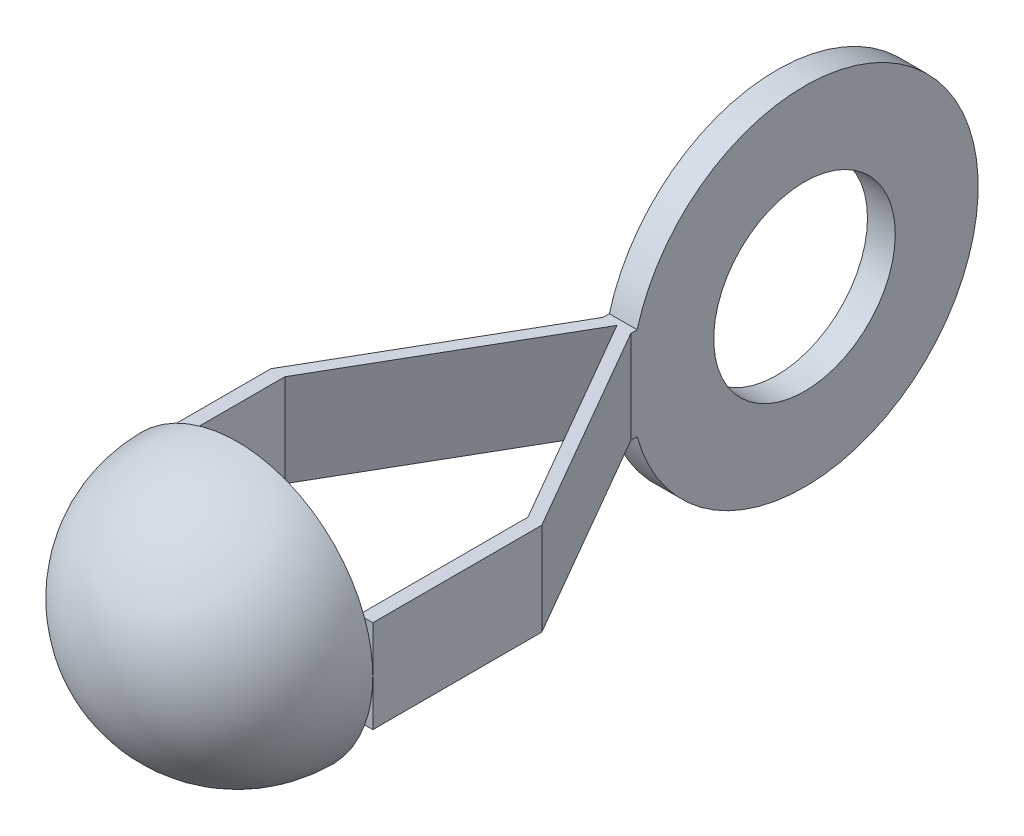
ISO-10303-21;
HEADER;
FILE_DESCRIPTION(('STEP AP214'),'2;1');
FILE_NAME('part.step','',(''),(''),'','','');
FILE_SCHEMA(('AUTOMOTIVE_DESIGN { 1 0 10303 214 1 1 1 1 }'));
ENDSEC;
DATA;
#1=APPLICATION_CONTEXT('core data for automotive mechanical design processes');
#2=APPLICATION_PROTOCOL_DEFINITION('international standard','automotive_design',2000,#1);
#3=PRODUCT_CONTEXT('',#1,'mechanical');
#4=PRODUCT('Part','Part','',(#3));
#5=PRODUCT_RELATED_PRODUCT_CATEGORY('part','',(#4));
#6=PRODUCT_DEFINITION_FORMATION('','',#4);
#7=PRODUCT_DEFINITION_CONTEXT('part definition',#1,'design');
#8=PRODUCT_DEFINITION('design','',#6,#7);
#9=PRODUCT_DEFINITION_SHAPE('','',#8);
#10=(LENGTH_UNIT() NAMED_UNIT(*) SI_UNIT(.MILLI.,.METRE.));
#11=(NAMED_UNIT(*) PLANE_ANGLE_UNIT() SI_UNIT($,.RADIAN.));
#12=(NAMED_UNIT(*) SI_UNIT($,.STERADIAN.) SOLID_ANGLE_UNIT());
#13=UNCERTAINTY_MEASURE_WITH_UNIT(LENGTH_MEASURE(1.E-05),#10,'distance_accuracy_value','');
#14=(GEOMETRIC_REPRESENTATION_CONTEXT(3) GLOBAL_UNCERTAINTY_ASSIGNED_CONTEXT((#13)) GLOBAL_UNIT_ASSIGNED_CONTEXT((#10,
#11,#12)) REPRESENTATION_CONTEXT('',''));
#15=CARTESIAN_POINT('',(0.,0.,0.));
#16=DIRECTION('',(0.,0.,1.));
#17=DIRECTION('',(1.,0.,0.));
#18=AXIS2_PLACEMENT_3D('',#15,#16,#17);
#19=CARTESIAN_POINT('',(-3.33375000000001,4.7625,10.4097243797327));
#20=DIRECTION('',(0.,0.,1.));
#21=DIRECTION('',(1.,0.,0.));
#22=AXIS2_PLACEMENT_3D('',#19,#20,#21);
#23=PLANE('',#22);
#24=DIRECTION('',(-1.,0.,0.));
#25=VECTOR('',#24,1.);
#26=CARTESIAN_POINT('',(3.71475000000001,-1.27,10.4097243797327));
#27=LINE('',#26,#25);
#28=CARTESIAN_POINT('',(-3.49091213904046,-1.27,10.4097243797327));
#29=VERTEX_POINT('',#28);
#30=CARTESIAN_POINT('',(-3.71475000000001,-1.27,10.4097243797327));
#31=VERTEX_POINT('',#30);
#32=EDGE_CURVE('E582',#29,#31,#27,.T.);
#33=ORIENTED_EDGE('',*,*,#32,.F.);
#34=CARTESIAN_POINT('',(0.,0.,10.4097243797327));
#35=DIRECTION('',(0.,0.,-1.));
#36=DIRECTION('',(1.,0.,0.));
#37=AXIS2_PLACEMENT_3D('',#34,#35,#36);
#38=CIRCLE('',#37,3.71475000000001);
#39=CARTESIAN_POINT('',(-3.71475000000001,0.,10.4097243797327));
#40=VERTEX_POINT('',#39);
#41=EDGE_CURVE('E348',#29,#40,#38,.T.);
#42=ORIENTED_EDGE('',*,*,#41,.T.);
#43=DIRECTION('',(0.,-1.,0.));
#44=VECTOR('',#43,1.);
#45=CARTESIAN_POINT('',(-3.71475000000001,4.7625,10.4097243797327));
#46=LINE('',#45,#44);
#47=EDGE_CURVE('E546',#40,#31,#46,.T.);
#48=ORIENTED_EDGE('',*,*,#47,.T.);
#49=EDGE_LOOP('',(#33,#42,#48));
#50=FACE_BOUND('',#49,.T.);
#51=ADVANCED_FACE('F325',(#50),#23,.T.);
#52=CARTESIAN_POINT('',(3.33375000000001,4.7625,10.4097243797327));
#53=DIRECTION('',(0.,0.,-1.));
#54=DIRECTION('',(-1.,0.,0.));
#55=AXIS2_PLACEMENT_3D('',#52,#53,#54);
#56=PLANE('',#55);
#57=CARTESIAN_POINT('',(3.71475000000001,0.,10.4097243797327));
#58=VERTEX_POINT('',#57);
#59=CARTESIAN_POINT('',(3.49091213904046,-1.27,10.4097243797328));
#60=VERTEX_POINT('',#59);
#61=EDGE_CURVE('E446',#58,#60,#38,.T.);
#62=ORIENTED_EDGE('',*,*,#61,.T.);
#63=DIRECTION('',(1.,0.,0.));
#64=VECTOR('',#63,1.);
#65=CARTESIAN_POINT('',(0.,-1.27,10.4097243797327));
#66=LINE('',#65,#64);
#67=CARTESIAN_POINT('',(3.71475000000001,-1.27,10.4097243797327));
#68=VERTEX_POINT('',#67);
#69=EDGE_CURVE('E471',#60,#68,#66,.T.);
#70=ORIENTED_EDGE('',*,*,#69,.T.);
#71=DIRECTION('',(0.,-1.,0.));
#72=VECTOR('',#71,1.);
#73=CARTESIAN_POINT('',(3.71475000000001,4.7625,10.4097243797327));
#74=LINE('',#73,#72);
#75=EDGE_CURVE('E469',#58,#68,#74,.T.);
#76=ORIENTED_EDGE('',*,*,#75,.F.);
#77=EDGE_LOOP('',(#62,#70,#76));
#78=FACE_BOUND('',#77,.T.);
#79=ADVANCED_FACE('F470',(#78),#56,.F.);
#80=CARTESIAN_POINT('',(0.,4.7625,0.));
#81=DIRECTION('',(0.866025403784438,0.,0.500000000000001));
#82=DIRECTION('',(0.500000000000001,0.,-0.866025403784438));
#83=AXIS2_PLACEMENT_3D('',#80,#81,#82);
#84=PLANE('',#83);
#85=DIRECTION('',(0.,-1.,0.));
#86=VECTOR('',#85,1.);
#87=CARTESIAN_POINT('',(0.,4.7625,0.));
#88=LINE('',#87,#86);
#89=CARTESIAN_POINT('',(0.,1.27,0.));
#90=VERTEX_POINT('',#89);
#91=CARTESIAN_POINT('',(0.,-1.27,0.));
#92=VERTEX_POINT('',#91);
#93=EDGE_CURVE('E489',#90,#92,#88,.T.);
#94=ORIENTED_EDGE('',*,*,#93,.F.);
#95=DIRECTION('',(-0.500000000000001,0.,0.866025403784438));
#96=VECTOR('',#95,1.);
#97=CARTESIAN_POINT('',(0.,1.27,0.));
#98=LINE('',#97,#96);
#99=CARTESIAN_POINT('',(-3.33375000000001,1.27,5.77422437973274));
#100=VERTEX_POINT('',#99);
#101=EDGE_CURVE('E564',#90,#100,#98,.T.);
#102=ORIENTED_EDGE('',*,*,#101,.T.);
#103=DIRECTION('',(0.,-1.,0.));
#104=VECTOR('',#103,1.);
#105=CARTESIAN_POINT('',(-3.33375000000001,4.7625,5.77422437973274));
#106=LINE('',#105,#104);
#107=CARTESIAN_POINT('',(-3.33375000000001,-1.27,5.77422437973274));
#108=VERTEX_POINT('',#107);
#109=EDGE_CURVE('E548',#100,#108,#106,.T.);
#110=ORIENTED_EDGE('',*,*,#109,.T.);
#111=DIRECTION('',(-0.500000000000001,0.,0.866025403784438));
#112=VECTOR('',#111,1.);
#113=CARTESIAN_POINT('',(0.,-1.27,0.));
#114=LINE('',#113,#112);
#115=EDGE_CURVE('E575',#92,#108,#114,.T.);
#116=ORIENTED_EDGE('',*,*,#115,.F.);
#117=EDGE_LOOP('',(#94,#102,#110,#116));
#118=FACE_BOUND('',#117,.T.);
#119=ADVANCED_FACE('F615',(#118),#84,.T.);
#120=CARTESIAN_POINT('',(-3.33375000000001,4.7625,5.77422437973274));
#121=DIRECTION('',(1.,0.,0.));
#122=DIRECTION('',(0.,0.,-1.));
#123=AXIS2_PLACEMENT_3D('',#120,#121,#122);
#124=PLANE('',#123);
#125=ORIENTED_EDGE('',*,*,#109,.F.);
#126=DIRECTION('',(0.,0.,1.));
#127=VECTOR('',#126,1.);
#128=CARTESIAN_POINT('',(-3.33375000000001,1.27,5.77422437973274));
#129=LINE('',#128,#127);
#130=CARTESIAN_POINT('',(-3.33375000000001,1.27,10.4097243797327));
#131=VERTEX_POINT('',#130);
#132=EDGE_CURVE('E562',#100,#131,#129,.T.);
#133=ORIENTED_EDGE('',*,*,#132,.T.);
#134=DIRECTION('',(0.,-1.,0.));
#135=VECTOR('',#134,1.);
#136=CARTESIAN_POINT('',(-3.33375000000001,4.7625,10.4097243797327));
#137=LINE('',#136,#135);
#138=CARTESIAN_POINT('',(-3.33375000000001,0.,10.4097243797327));
#139=VERTEX_POINT('',#138);
#140=EDGE_CURVE('E340',#131,#139,#137,.T.);
#141=ORIENTED_EDGE('',*,*,#140,.T.);
#142=DIRECTION('',(0.,1.,0.));
#143=VECTOR('',#142,1.);
#144=CARTESIAN_POINT('',(-3.33375000000001,4.76250000000003,10.4097243797327));
#145=LINE('',#144,#143);
#146=CARTESIAN_POINT('',(-3.33375000000001,-1.27,10.4097243797327));
#147=VERTEX_POINT('',#146);
#148=EDGE_CURVE('E585',#147,#139,#145,.T.);
#149=ORIENTED_EDGE('',*,*,#148,.F.);
#150=DIRECTION('',(0.,0.,1.));
#151=VECTOR('',#150,1.);
#152=CARTESIAN_POINT('',(-3.33375000000001,-1.27,5.77422437973274));
#153=LINE('',#152,#151);
#154=EDGE_CURVE('E572',#108,#147,#153,.T.);
#155=ORIENTED_EDGE('',*,*,#154,.F.);
#156=EDGE_LOOP('',(#125,#133,#141,#149,#155));
#157=FACE_BOUND('',#156,.T.);
#158=ADVANCED_FACE('F618',(#157),#124,.T.);
#159=CARTESIAN_POINT('',(-3.71475000000001,1.27,10.4097243797327));
#160=VERTEX_POINT('',#159);
#161=EDGE_CURVE('E543',#160,#40,#46,.T.);
#162=ORIENTED_EDGE('',*,*,#161,.T.);
#163=CARTESIAN_POINT('',(-3.49091213904046,1.27,10.4097243797327));
#164=VERTEX_POINT('',#163);
#165=EDGE_CURVE('E623',#40,#164,#38,.T.);
#166=ORIENTED_EDGE('',*,*,#165,.T.);
#167=DIRECTION('',(-1.,0.,0.));
#168=VECTOR('',#167,1.);
#169=CARTESIAN_POINT('',(3.71475000000001,1.27,10.4097243797327));
#170=LINE('',#169,#168);
#171=EDGE_CURVE('E588',#164,#160,#170,.T.);
#172=ORIENTED_EDGE('',*,*,#171,.T.);
#173=EDGE_LOOP('',(#162,#166,#172));
#174=FACE_BOUND('',#173,.T.);
#175=ADVANCED_FACE('F648',(#174),#23,.T.);
#176=CARTESIAN_POINT('',(-3.71475000000001,4.7625,10.4097243797327));
#177=DIRECTION('',(-1.,0.,0.));
#178=DIRECTION('',(0.,0.,1.));
#179=AXIS2_PLACEMENT_3D('',#176,#177,#178);
#180=PLANE('',#179);
#181=ORIENTED_EDGE('',*,*,#161,.F.);
#182=DIRECTION('',(0.,0.,-1.));
#183=VECTOR('',#182,1.);
#184=CARTESIAN_POINT('',(-3.71475000000001,1.27,0.));
#185=LINE('',#184,#183);
#186=CARTESIAN_POINT('',(-3.71475000000001,1.27,5.77422437973274));
#187=VERTEX_POINT('',#186);
#188=EDGE_CURVE('E581',#160,#187,#185,.T.);
#189=ORIENTED_EDGE('',*,*,#188,.T.);
#190=DIRECTION('',(0.,-1.,0.));
#191=VECTOR('',#190,1.);
#192=CARTESIAN_POINT('',(-3.71475000000001,4.7625,5.77422437973274));
#193=LINE('',#192,#191);
#194=CARTESIAN_POINT('',(-3.71475000000001,-1.27,5.77422437973274));
#195=VERTEX_POINT('',#194);
#196=EDGE_CURVE('E540',#187,#195,#193,.T.);
#197=ORIENTED_EDGE('',*,*,#196,.T.);
#198=DIRECTION('',(0.,0.,-1.));
#199=VECTOR('',#198,1.);
#200=CARTESIAN_POINT('',(-3.71475000000001,-1.27,0.));
#201=LINE('',#200,#199);
#202=EDGE_CURVE('E583',#31,#195,#201,.T.);
#203=ORIENTED_EDGE('',*,*,#202,.F.);
#204=ORIENTED_EDGE('',*,*,#47,.F.);
#205=EDGE_LOOP('',(#181,#189,#197,#203,#204));
#206=FACE_BOUND('',#205,.T.);
#207=ADVANCED_FACE('F630',(#206),#180,.T.);
#208=CARTESIAN_POINT('',(-3.71475000000001,4.7625,5.77422437973274));
#209=DIRECTION('',(-0.866025403784438,0.,-0.500000000000001));
#210=DIRECTION('',(-0.500000000000001,0.,0.866025403784438));
#211=AXIS2_PLACEMENT_3D('',#208,#209,#210);
#212=PLANE('',#211);
#213=ORIENTED_EDGE('',*,*,#196,.F.);
#214=DIRECTION('',(0.500000000000001,0.,-0.866025403784438));
#215=VECTOR('',#214,1.);
#216=CARTESIAN_POINT('',(-3.71475000000001,1.27,5.77422437973274));
#217=LINE('',#216,#215);
#218=CARTESIAN_POINT('',(-0.381000000000001,1.27,0.));
#219=VERTEX_POINT('',#218);
#220=EDGE_CURVE('E559',#187,#219,#217,.T.);
#221=ORIENTED_EDGE('',*,*,#220,.T.);
#222=DIRECTION('',(0.,-1.,0.));
#223=VECTOR('',#222,1.);
#224=CARTESIAN_POINT('',(-0.381,4.7625,0.));
#225=LINE('',#224,#223);
#226=CARTESIAN_POINT('',(-0.381000000000001,-1.27,0.));
#227=VERTEX_POINT('',#226);
#228=EDGE_CURVE('E509',#219,#227,#225,.T.);
#229=ORIENTED_EDGE('',*,*,#228,.T.);
#230=DIRECTION('',(0.500000000000001,0.,-0.866025403784438));
#231=VECTOR('',#230,1.);
#232=CARTESIAN_POINT('',(-3.71475000000001,-1.27,5.77422437973274));
#233=LINE('',#232,#231);
#234=EDGE_CURVE('E570',#195,#227,#233,.T.);
#235=ORIENTED_EDGE('',*,*,#234,.F.);
#236=EDGE_LOOP('',(#213,#221,#229,#235));
#237=FACE_BOUND('',#236,.T.);
#238=ADVANCED_FACE('F634',(#237),#212,.T.);
#239=CARTESIAN_POINT('',(-0.381,4.7625,0.));
#240=DIRECTION('',(-1.,0.,0.));
#241=DIRECTION('',(0.,0.,1.));
#242=AXIS2_PLACEMENT_3D('',#239,#240,#241);
#243=PLANE('',#242);
#244=DIRECTION('',(0.,0.,-1.));
#245=VECTOR('',#244,1.);
#246=CARTESIAN_POINT('',(-0.381,1.27,0.));
#247=LINE('',#246,#245);
#248=CARTESIAN_POINT('',(-0.381,1.27,-0.172455746400693));
#249=VERTEX_POINT('',#248);
#250=EDGE_CURVE('E556',#219,#249,#247,.T.);
#251=ORIENTED_EDGE('',*,*,#250,.T.);
#252=CARTESIAN_POINT('',(-0.381,0.,-4.7625));
#253=DIRECTION('',(-1.,0.,0.));
#254=DIRECTION('',(0.,0.,1.));
#255=AXIS2_PLACEMENT_3D('',#252,#253,#254);
#256=CIRCLE('',#255,4.7625);
#257=CARTESIAN_POINT('',(-0.381,-1.27,-0.172455746400693));
#258=VERTEX_POINT('',#257);
#259=EDGE_CURVE('E551',#258,#249,#256,.F.);
#260=ORIENTED_EDGE('',*,*,#259,.F.);
#261=DIRECTION('',(0.,0.,-1.));
#262=VECTOR('',#261,1.);
#263=CARTESIAN_POINT('',(-0.381,-1.27,0.));
#264=LINE('',#263,#262);
#265=EDGE_CURVE('E567',#227,#258,#264,.T.);
#266=ORIENTED_EDGE('',*,*,#265,.F.);
#267=ORIENTED_EDGE('',*,*,#228,.F.);
#268=EDGE_LOOP('',(#251,#260,#266,#267));
#269=FACE_BOUND('',#268,.T.);
#270=CARTESIAN_POINT('',(-0.381,0.,-4.7625));
#271=DIRECTION('',(-1.,0.,0.));
#272=DIRECTION('',(0.,0.,1.));
#273=AXIS2_PLACEMENT_3D('',#270,#271,#272);
#274=CIRCLE('',#273,2.4892);
#275=CARTESIAN_POINT('',(-0.381,0.,-7.2517));
#276=VERTEX_POINT('',#275);
#277=EDGE_CURVE('E553',#276,#276,#274,.F.);
#278=ORIENTED_EDGE('',*,*,#277,.T.);
#279=EDGE_LOOP('',(#278));
#280=FACE_BOUND('',#279,.T.);
#281=ADVANCED_FACE('F638',(#269,#280),#243,.T.);
#282=CARTESIAN_POINT('',(0.381,4.7625,0.));
#283=DIRECTION('',(-1.,0.,0.));
#284=DIRECTION('',(0.,0.,1.));
#285=AXIS2_PLACEMENT_3D('',#282,#283,#284);
#286=PLANE('',#285);
#287=CARTESIAN_POINT('',(0.381,0.,-4.7625));
#288=DIRECTION('',(-1.,0.,0.));
#289=DIRECTION('',(0.,0.,1.));
#290=AXIS2_PLACEMENT_3D('',#287,#288,#289);
#291=CIRCLE('',#290,2.4892);
#292=CARTESIAN_POINT('',(0.381,0.,-7.2517));
#293=VERTEX_POINT('',#292);
#294=EDGE_CURVE('E492',#293,#293,#291,.T.);
#295=ORIENTED_EDGE('',*,*,#294,.T.);
#296=EDGE_LOOP('',(#295));
#297=FACE_BOUND('',#296,.T.);
#298=CARTESIAN_POINT('',(0.381,0.,-4.7625));
#299=DIRECTION('',(-1.,0.,0.));
#300=DIRECTION('',(0.,0.,1.));
#301=AXIS2_PLACEMENT_3D('',#298,#299,#300);
#302=CIRCLE('',#301,4.7625);
#303=CARTESIAN_POINT('',(0.381,1.27,-0.172455746400693));
#304=VERTEX_POINT('',#303);
#305=CARTESIAN_POINT('',(0.381,-1.27,-0.172455746400693));
#306=VERTEX_POINT('',#305);
#307=EDGE_CURVE('E494',#304,#306,#302,.T.);
#308=ORIENTED_EDGE('',*,*,#307,.F.);
#309=DIRECTION('',(0.,0.,1.));
#310=VECTOR('',#309,1.);
#311=CARTESIAN_POINT('',(0.381,1.27,0.));
#312=LINE('',#311,#310);
#313=CARTESIAN_POINT('',(0.381000000000001,1.27,0.));
#314=VERTEX_POINT('',#313);
#315=EDGE_CURVE('E522',#304,#314,#312,.T.);
#316=ORIENTED_EDGE('',*,*,#315,.T.);
#317=DIRECTION('',(0.,-1.,0.));
#318=VECTOR('',#317,1.);
#319=CARTESIAN_POINT('',(0.381,4.7625,0.));
#320=LINE('',#319,#318);
#321=CARTESIAN_POINT('',(0.381000000000001,-1.27,0.));
#322=VERTEX_POINT('',#321);
#323=EDGE_CURVE('E512',#314,#322,#320,.T.);
#324=ORIENTED_EDGE('',*,*,#323,.T.);
#325=DIRECTION('',(0.,0.,1.));
#326=VECTOR('',#325,1.);
#327=CARTESIAN_POINT('',(0.381,-1.27,0.));
#328=LINE('',#327,#326);
#329=EDGE_CURVE('E503',#306,#322,#328,.T.);
#330=ORIENTED_EDGE('',*,*,#329,.F.);
#331=EDGE_LOOP('',(#308,#316,#324,#330));
#332=FACE_BOUND('',#331,.T.);
#333=ADVANCED_FACE('F644',(#297,#332),#286,.F.);
#334=CARTESIAN_POINT('',(0.,4.7625,0.));
#335=DIRECTION('',(0.866025403784438,0.,-0.500000000000001));
#336=DIRECTION('',(-0.500000000000001,0.,-0.866025403784438));
#337=AXIS2_PLACEMENT_3D('',#334,#335,#336);
#338=PLANE('',#337);
#339=DIRECTION('',(0.,-1.,0.));
#340=VECTOR('',#339,1.);
#341=CARTESIAN_POINT('',(3.33375000000001,4.7625,5.77422437973274));
#342=LINE('',#341,#340);
#343=CARTESIAN_POINT('',(3.33375000000001,1.27,5.77422437973274));
#344=VERTEX_POINT('',#343);
#345=CARTESIAN_POINT('',(3.33375000000001,-1.27,5.77422437973274));
#346=VERTEX_POINT('',#345);
#347=EDGE_CURVE('E482',#344,#346,#342,.T.);
#348=ORIENTED_EDGE('',*,*,#347,.F.);
#349=DIRECTION('',(-0.500000000000001,0.,-0.866025403784438));
#350=VECTOR('',#349,1.);
#351=CARTESIAN_POINT('',(0.,1.27,0.));
#352=LINE('',#351,#350);
#353=EDGE_CURVE('E495',#344,#90,#352,.T.);
#354=ORIENTED_EDGE('',*,*,#353,.T.);
#355=ORIENTED_EDGE('',*,*,#93,.T.);
#356=DIRECTION('',(-0.500000000000001,0.,-0.866025403784438));
#357=VECTOR('',#356,1.);
#358=CARTESIAN_POINT('',(0.,-1.27,0.));
#359=LINE('',#358,#357);
#360=EDGE_CURVE('E524',#346,#92,#359,.T.);
#361=ORIENTED_EDGE('',*,*,#360,.F.);
#362=EDGE_LOOP('',(#348,#354,#355,#361));
#363=FACE_BOUND('',#362,.T.);
#364=ADVANCED_FACE('F327',(#363),#338,.F.);
#365=CARTESIAN_POINT('',(3.33375000000001,4.7625,5.77422437973274));
#366=DIRECTION('',(1.,0.,0.));
#367=DIRECTION('',(0.,0.,-1.));
#368=AXIS2_PLACEMENT_3D('',#365,#366,#367);
#369=PLANE('',#368);
#370=DIRECTION('',(0.,-1.,0.));
#371=VECTOR('',#370,1.);
#372=CARTESIAN_POINT('',(3.33375000000001,4.7625,10.4097243797327));
#373=LINE('',#372,#371);
#374=CARTESIAN_POINT('',(3.33375000000001,1.27,10.4097243797327));
#375=VERTEX_POINT('',#374);
#376=CARTESIAN_POINT('',(3.33375000000001,0.,10.4097243797327));
#377=VERTEX_POINT('',#376);
#378=EDGE_CURVE('E481',#375,#377,#373,.T.);
#379=ORIENTED_EDGE('',*,*,#378,.F.);
#380=DIRECTION('',(0.,0.,-1.));
#381=VECTOR('',#380,1.);
#382=CARTESIAN_POINT('',(3.33375000000001,1.27,5.77422437973274));
#383=LINE('',#382,#381);
#384=EDGE_CURVE('E519',#375,#344,#383,.T.);
#385=ORIENTED_EDGE('',*,*,#384,.T.);
#386=ORIENTED_EDGE('',*,*,#347,.T.);
#387=DIRECTION('',(0.,0.,-1.));
#388=VECTOR('',#387,1.);
#389=CARTESIAN_POINT('',(3.33375000000001,-1.27,5.77422437973274));
#390=LINE('',#389,#388);
#391=CARTESIAN_POINT('',(3.33375000000001,-1.27,10.4097243797328));
#392=VERTEX_POINT('',#391);
#393=EDGE_CURVE('E526',#392,#346,#390,.T.);
#394=ORIENTED_EDGE('',*,*,#393,.F.);
#395=DIRECTION('',(0.,1.,0.));
#396=VECTOR('',#395,1.);
#397=CARTESIAN_POINT('',(3.33375000000001,4.76250000000003,10.4097243797327));
#398=LINE('',#397,#396);
#399=EDGE_CURVE('E458',#392,#377,#398,.T.);
#400=ORIENTED_EDGE('',*,*,#399,.T.);
#401=EDGE_LOOP('',(#379,#385,#386,#394,#400));
#402=FACE_BOUND('',#401,.T.);
#403=ADVANCED_FACE('F609',(#402),#369,.F.);
#404=CARTESIAN_POINT('',(3.49091213904046,1.27,10.4097243797327));
#405=VERTEX_POINT('',#404);
#406=EDGE_CURVE('E450',#405,#58,#38,.T.);
#407=ORIENTED_EDGE('',*,*,#406,.T.);
#408=CARTESIAN_POINT('',(3.71475000000001,1.27,10.4097243797327));
#409=VERTEX_POINT('',#408);
#410=EDGE_CURVE('E464',#409,#58,#74,.T.);
#411=ORIENTED_EDGE('',*,*,#410,.F.);
#412=DIRECTION('',(1.,0.,0.));
#413=VECTOR('',#412,1.);
#414=CARTESIAN_POINT('',(0.,1.27,10.4097243797327));
#415=LINE('',#414,#413);
#416=EDGE_CURVE('E465',#405,#409,#415,.T.);
#417=ORIENTED_EDGE('',*,*,#416,.F.);
#418=EDGE_LOOP('',(#407,#411,#417));
#419=FACE_BOUND('',#418,.T.);
#420=ADVANCED_FACE('F462',(#419),#56,.F.);
#421=CARTESIAN_POINT('',(3.71475000000001,4.7625,10.4097243797327));
#422=DIRECTION('',(-1.,0.,0.));
#423=DIRECTION('',(0.,0.,1.));
#424=AXIS2_PLACEMENT_3D('',#421,#422,#423);
#425=PLANE('',#424);
#426=DIRECTION('',(0.,-1.,0.));
#427=VECTOR('',#426,1.);
#428=CARTESIAN_POINT('',(3.71475000000001,4.7625,5.77422437973274));
#429=LINE('',#428,#427);
#430=CARTESIAN_POINT('',(3.71475000000001,1.27,5.77422437973274));
#431=VERTEX_POINT('',#430);
#432=CARTESIAN_POINT('',(3.71475000000001,-1.27,5.77422437973274));
#433=VERTEX_POINT('',#432);
#434=EDGE_CURVE('E475',#431,#433,#429,.T.);
#435=ORIENTED_EDGE('',*,*,#434,.F.);
#436=DIRECTION('',(0.,0.,-1.));
#437=VECTOR('',#436,1.);
#438=CARTESIAN_POINT('',(3.71475000000001,1.27,0.));
#439=LINE('',#438,#437);
#440=EDGE_CURVE('E480',#409,#431,#439,.T.);
#441=ORIENTED_EDGE('',*,*,#440,.F.);
#442=ORIENTED_EDGE('',*,*,#410,.T.);
#443=ORIENTED_EDGE('',*,*,#75,.T.);
#444=DIRECTION('',(0.,0.,-1.));
#445=VECTOR('',#444,1.);
#446=CARTESIAN_POINT('',(3.71475000000001,-1.27,0.));
#447=LINE('',#446,#445);
#448=EDGE_CURVE('E500',#68,#433,#447,.T.);
#449=ORIENTED_EDGE('',*,*,#448,.T.);
#450=EDGE_LOOP('',(#435,#441,#442,#443,#449));
#451=FACE_BOUND('',#450,.T.);
#452=ADVANCED_FACE('F479',(#451),#425,.F.);
#453=CARTESIAN_POINT('',(3.71475000000001,4.7625,5.77422437973274));
#454=DIRECTION('',(-0.866025403784438,0.,0.500000000000001));
#455=DIRECTION('',(0.500000000000001,0.,0.866025403784438));
#456=AXIS2_PLACEMENT_3D('',#453,#454,#455);
#457=PLANE('',#456);
#458=ORIENTED_EDGE('',*,*,#323,.F.);
#459=DIRECTION('',(0.500000000000001,0.,0.866025403784438));
#460=VECTOR('',#459,1.);
#461=CARTESIAN_POINT('',(3.71475000000001,1.27,5.77422437973274));
#462=LINE('',#461,#460);
#463=EDGE_CURVE('E12',#314,#431,#462,.T.);
#464=ORIENTED_EDGE('',*,*,#463,.T.);
#465=ORIENTED_EDGE('',*,*,#434,.T.);
#466=DIRECTION('',(0.500000000000001,0.,0.866025403784438));
#467=VECTOR('',#466,1.);
#468=CARTESIAN_POINT('',(3.71475000000001,-1.27,5.77422437973274));
#469=LINE('',#468,#467);
#470=EDGE_CURVE('E333',#322,#433,#469,.T.);
#471=ORIENTED_EDGE('',*,*,#470,.F.);
#472=EDGE_LOOP('',(#458,#464,#465,#471));
#473=FACE_BOUND('',#472,.T.);
#474=ADVANCED_FACE('F511',(#473),#457,.F.);
#475=CARTESIAN_POINT('',(0.,0.,-4.7625));
#476=DIRECTION('',(1.,0.,0.));
#477=DIRECTION('',(0.,0.,-1.));
#478=AXIS2_PLACEMENT_3D('',#475,#476,#477);
#479=CYLINDRICAL_SURFACE('',#478,4.7625);
#480=ORIENTED_EDGE('',*,*,#307,.T.);
#481=DIRECTION('',(1.,0.,0.));
#482=VECTOR('',#481,1.);
#483=CARTESIAN_POINT('',(0.,-1.27,-0.172455746400693));
#484=LINE('',#483,#482);
#485=EDGE_CURVE('E508',#258,#306,#484,.T.);
#486=ORIENTED_EDGE('',*,*,#485,.F.);
#487=ORIENTED_EDGE('',*,*,#259,.T.);
#488=DIRECTION('',(1.,0.,0.));
#489=VECTOR('',#488,1.);
#490=CARTESIAN_POINT('',(0.,1.27,-0.172455746400693));
#491=LINE('',#490,#489);
#492=EDGE_CURVE('E529',#249,#304,#491,.T.);
#493=ORIENTED_EDGE('',*,*,#492,.T.);
#494=EDGE_LOOP('',(#480,#486,#487,#493));
#495=FACE_BOUND('',#494,.T.);
#496=ADVANCED_FACE('F643',(#495),#479,.T.);
#497=CARTESIAN_POINT('',(0.,0.,-4.7625));
#498=DIRECTION('',(1.,0.,0.));
#499=DIRECTION('',(0.,0.,-1.));
#500=AXIS2_PLACEMENT_3D('',#497,#498,#499);
#501=CYLINDRICAL_SURFACE('',#500,2.4892);
#502=CARTESIAN_POINT('',(0.381,0.,-7.2517));
#503=CARTESIAN_POINT('',(0.3730625,0.,-7.2517));
#504=CARTESIAN_POINT('',(0.365125,0.,-7.2517));
#505=CARTESIAN_POINT('',(0.34925,0.,-7.2517));
#506=CARTESIAN_POINT('',(0.3413125,0.,-7.2517));
#507=CARTESIAN_POINT('',(0.3254375,0.,-7.2517));
#508=CARTESIAN_POINT('',(0.3175,0.,-7.2517));
#509=CARTESIAN_POINT('',(0.301625,0.,-7.2517));
#510=CARTESIAN_POINT('',(0.2936875,0.,-7.2517));
#511=CARTESIAN_POINT('',(0.2778125,0.,-7.2517));
#512=CARTESIAN_POINT('',(0.269875,0.,-7.2517));
#513=CARTESIAN_POINT('',(0.254,0.,-7.2517));
#514=CARTESIAN_POINT('',(0.2460625,0.,-7.2517));
#515=CARTESIAN_POINT('',(0.2301875,0.,-7.2517));
#516=CARTESIAN_POINT('',(0.22225,0.,-7.2517));
#517=CARTESIAN_POINT('',(0.206375,0.,-7.2517));
#518=CARTESIAN_POINT('',(0.1984375,0.,-7.2517));
#519=CARTESIAN_POINT('',(0.1825625,0.,-7.2517));
#520=CARTESIAN_POINT('',(0.174625,0.,-7.2517));
#521=CARTESIAN_POINT('',(0.15875,0.,-7.2517));
#522=CARTESIAN_POINT('',(0.1508125,0.,-7.2517));
#523=CARTESIAN_POINT('',(0.1349375,0.,-7.2517));
#524=CARTESIAN_POINT('',(0.127,0.,-7.2517));
#525=CARTESIAN_POINT('',(0.111125,0.,-7.2517));
#526=CARTESIAN_POINT('',(0.1031875,0.,-7.2517));
#527=CARTESIAN_POINT('',(0.0873125000000001,0.,-7.2517));
#528=CARTESIAN_POINT('',(0.0793750000000001,0.,-7.2517));
#529=CARTESIAN_POINT('',(0.0635000000000001,0.,-7.2517));
#530=CARTESIAN_POINT('',(0.0555625000000001,0.,-7.2517));
#531=CARTESIAN_POINT('',(0.0396875000000001,0.,-7.2517));
#532=CARTESIAN_POINT('',(0.0317500000000001,0.,-7.2517));
#533=CARTESIAN_POINT('',(0.0158750000000001,0.,-7.2517));
#534=CARTESIAN_POINT('',(0.00793750000000011,0.,-7.2517));
#535=CARTESIAN_POINT('',(-0.0079374999999999,0.,-7.2517));
#536=CARTESIAN_POINT('',(-0.0158749999999999,0.,-7.2517));
#537=CARTESIAN_POINT('',(-0.0317499999999999,0.,-7.2517));
#538=CARTESIAN_POINT('',(-0.0396874999999999,0.,-7.2517));
#539=CARTESIAN_POINT('',(-0.0555624999999999,0.,-7.2517));
#540=CARTESIAN_POINT('',(-0.0634999999999999,0.,-7.2517));
#541=CARTESIAN_POINT('',(-0.0793749999999999,0.,-7.2517));
#542=CARTESIAN_POINT('',(-0.0873124999999998,0.,-7.2517));
#543=CARTESIAN_POINT('',(-0.1031875,0.,-7.2517));
#544=CARTESIAN_POINT('',(-0.111125,0.,-7.2517));
#545=CARTESIAN_POINT('',(-0.127,0.,-7.2517));
#546=CARTESIAN_POINT('',(-0.1349375,0.,-7.2517));
#547=CARTESIAN_POINT('',(-0.1508125,0.,-7.2517));
#548=CARTESIAN_POINT('',(-0.15875,0.,-7.2517));
#549=CARTESIAN_POINT('',(-0.174625,0.,-7.2517));
#550=CARTESIAN_POINT('',(-0.1825625,0.,-7.2517));
#551=CARTESIAN_POINT('',(-0.1984375,0.,-7.2517));
#552=CARTESIAN_POINT('',(-0.206375,0.,-7.2517));
#553=CARTESIAN_POINT('',(-0.22225,0.,-7.2517));
#554=CARTESIAN_POINT('',(-0.2301875,0.,-7.2517));
#555=CARTESIAN_POINT('',(-0.2460625,0.,-7.2517));
#556=CARTESIAN_POINT('',(-0.254,0.,-7.2517));
#557=CARTESIAN_POINT('',(-0.269875,0.,-7.2517));
#558=CARTESIAN_POINT('',(-0.2778125,0.,-7.2517));
#559=CARTESIAN_POINT('',(-0.2936875,0.,-7.2517));
#560=CARTESIAN_POINT('',(-0.301625,0.,-7.2517));
#561=CARTESIAN_POINT('',(-0.3175,0.,-7.2517));
#562=CARTESIAN_POINT('',(-0.3254375,0.,-7.2517));
#563=CARTESIAN_POINT('',(-0.3413125,0.,-7.2517));
#564=CARTESIAN_POINT('',(-0.34925,0.,-7.2517));
#565=CARTESIAN_POINT('',(-0.365125,0.,-7.2517));
#566=CARTESIAN_POINT('',(-0.3730625,0.,-7.2517));
#567=CARTESIAN_POINT('',(-0.381,0.,-7.2517));
#568=B_SPLINE_CURVE_WITH_KNOTS('',3,(#502,#503,#504,#505,#506,#507,#508,#509,#510,#511,#512,
#513,#514,#515,#516,#517,#518,#519,#520,#521,#522,#523,#524,#525,#526,#527,#528,#529,#530,#531,
#532,#533,#534,#535,#536,#537,#538,#539,#540,#541,#542,#543,#544,#545,#546,#547,#548,#549,#550,
#551,#552,#553,#554,#555,#556,#557,#558,#559,#560,#561,#562,#563,#564,#565,#566,#567),
.UNSPECIFIED.,.F.,.F.,(4,2,2,2,2,2,2,2,2,2,2,2,2,2,2,2,2,2,2,2,2,2,2,2,2,2,2,2,2,2,2,2,4),(0.,
0.0238125,0.047625,0.0714375,0.09525,0.1190625,0.142875,0.1666875,0.1905,0.2143125,0.238125,
0.2619375,0.28575,0.3095625,0.333375,0.3571875,0.381,0.4048125,0.428625,0.4524375,0.47625,
0.5000625,0.523875,0.5476875,0.5715,0.5953125,0.619125,0.6429375,0.66675,0.6905625,0.714375,
0.7381875,0.762),.UNSPECIFIED.);
#569=EDGE_CURVE('BSEAM691',#293,#276,#568,.T.);
#570=ORIENTED_EDGE('',*,*,#294,.F.);
#571=ORIENTED_EDGE('',*,*,#277,.F.);
#572=ORIENTED_EDGE('',*,*,#569,.T.);
#573=ORIENTED_EDGE('',*,*,#569,.F.);
#574=EDGE_LOOP('',(#570,#572,#571,#573));
#575=FACE_BOUND('',#574,.T.);
#576=ADVANCED_FACE('F691',(#575),#501,.F.);
#577=CARTESIAN_POINT('',(0.,-1.27,0.));
#578=DIRECTION('',(0.,-1.,0.));
#579=DIRECTION('',(0.,0.,-1.));
#580=AXIS2_PLACEMENT_3D('',#577,#578,#579);
#581=PLANE('',#580);
#582=ORIENTED_EDGE('',*,*,#360,.T.);
#583=ORIENTED_EDGE('',*,*,#115,.T.);
#584=ORIENTED_EDGE('',*,*,#154,.T.);
#585=EDGE_CURVE('E578',#147,#29,#27,.T.);
#586=ORIENTED_EDGE('',*,*,#585,.T.);
#587=ORIENTED_EDGE('',*,*,#32,.T.);
#588=ORIENTED_EDGE('',*,*,#202,.T.);
#589=ORIENTED_EDGE('',*,*,#234,.T.);
#590=ORIENTED_EDGE('',*,*,#265,.T.);
#591=ORIENTED_EDGE('',*,*,#485,.T.);
#592=ORIENTED_EDGE('',*,*,#329,.T.);
#593=ORIENTED_EDGE('',*,*,#470,.T.);
#594=ORIENTED_EDGE('',*,*,#448,.F.);
#595=ORIENTED_EDGE('',*,*,#69,.F.);
#596=EDGE_CURVE('E531',#392,#60,#66,.T.);
#597=ORIENTED_EDGE('',*,*,#596,.F.);
#598=ORIENTED_EDGE('',*,*,#393,.T.);
#599=EDGE_LOOP('',(#582,#583,#584,#586,#587,#588,#589,#590,#591,#592,#593,#594,#595,#597,#598));
#600=FACE_BOUND('',#599,.T.);
#601=ADVANCED_FACE('F499',(#600),#581,.T.);
#602=CARTESIAN_POINT('',(0.,1.27,0.));
#603=DIRECTION('',(0.,-1.,0.));
#604=DIRECTION('',(0.,0.,-1.));
#605=AXIS2_PLACEMENT_3D('',#602,#603,#604);
#606=PLANE('',#605);
#607=ORIENTED_EDGE('',*,*,#384,.F.);
#608=EDGE_CURVE('E533',#375,#405,#415,.T.);
#609=ORIENTED_EDGE('',*,*,#608,.T.);
#610=ORIENTED_EDGE('',*,*,#416,.T.);
#611=ORIENTED_EDGE('',*,*,#440,.T.);
#612=ORIENTED_EDGE('',*,*,#463,.F.);
#613=ORIENTED_EDGE('',*,*,#315,.F.);
#614=ORIENTED_EDGE('',*,*,#492,.F.);
#615=ORIENTED_EDGE('',*,*,#250,.F.);
#616=ORIENTED_EDGE('',*,*,#220,.F.);
#617=ORIENTED_EDGE('',*,*,#188,.F.);
#618=ORIENTED_EDGE('',*,*,#171,.F.);
#619=EDGE_CURVE('E577',#131,#164,#170,.T.);
#620=ORIENTED_EDGE('',*,*,#619,.F.);
#621=ORIENTED_EDGE('',*,*,#132,.F.);
#622=ORIENTED_EDGE('',*,*,#101,.F.);
#623=ORIENTED_EDGE('',*,*,#353,.F.);
#624=EDGE_LOOP('',(#607,#609,#610,#611,#612,#613,#614,#615,#616,#617,#618,#620,#621,#622,#623));
#625=FACE_BOUND('',#624,.T.);
#626=ADVANCED_FACE('F647',(#625),#606,.F.);
#627=CARTESIAN_POINT('',(0.,0.,10.4097243797327));
#628=DIRECTION('',(0.,0.,-1.));
#629=DIRECTION('',(1.,0.,0.));
#630=AXIS2_PLACEMENT_3D('',#627,#628,#629);
#631=PLANE('',#630);
#632=EDGE_CURVE('E453',#60,#29,#38,.T.);
#633=ORIENTED_EDGE('',*,*,#632,.T.);
#634=ORIENTED_EDGE('',*,*,#585,.F.);
#635=ORIENTED_EDGE('',*,*,#148,.T.);
#636=CARTESIAN_POINT('',(0.,0.,10.4097243797327));
#637=DIRECTION('',(0.,0.,-1.));
#638=DIRECTION('',(1.,0.,0.));
#639=AXIS2_PLACEMENT_3D('',#636,#637,#638);
#640=CIRCLE('',#639,3.33375000000001);
#641=EDGE_CURVE('E468',#377,#139,#640,.T.);
#642=ORIENTED_EDGE('',*,*,#641,.F.);
#643=ORIENTED_EDGE('',*,*,#399,.F.);
#644=ORIENTED_EDGE('',*,*,#596,.T.);
#645=EDGE_LOOP('',(#633,#634,#635,#642,#643,#644));
#646=FACE_BOUND('',#645,.T.);
#647=ADVANCED_FACE('F603',(#646),#631,.T.);
#648=CARTESIAN_POINT('',(0.,0.,10.4097243797327));
#649=DIRECTION('',(1.,0.,0.));
#650=DIRECTION('',(0.,-1.,0.));
#651=AXIS2_PLACEMENT_3D('',#648,#649,#650);
#652=SPHERICAL_SURFACE('',#651,3.33375000000001);
#653=CARTESIAN_POINT('',(0.,0.,10.4097243797327));
#654=DIRECTION('',(0.,0.,-1.));
#655=DIRECTION('',(1.,0.,0.));
#656=AXIS2_PLACEMENT_3D('',#653,#654,#655);
#657=SPHERICAL_SURFACE('',#656,3.33375000000001);
#658=ORIENTED_EDGE('',*,*,#641,.T.);
#659=EDGE_CURVE('E595',#139,#377,#640,.T.);
#660=ORIENTED_EDGE('',*,*,#659,.T.);
#661=EDGE_LOOP('',(#658,#660));
#662=FACE_BOUND('',#661,.T.);
#663=ADVANCED_FACE('F600',(#662),#657,.F.);
#664=CARTESIAN_POINT('',(0.,0.,10.4097243797327));
#665=DIRECTION('',(1.,0.,0.));
#666=DIRECTION('',(0.,-1.,0.));
#667=AXIS2_PLACEMENT_3D('',#664,#665,#666);
#668=SPHERICAL_SURFACE('',#667,3.71475000000001);
#669=CARTESIAN_POINT('',(0.,0.,10.4097243797327));
#670=DIRECTION('',(0.,0.,-1.));
#671=DIRECTION('',(1.,0.,0.));
#672=AXIS2_PLACEMENT_3D('',#669,#670,#671);
#673=SPHERICAL_SURFACE('',#672,3.71475000000001);
#674=ORIENTED_EDGE('',*,*,#61,.F.);
#675=ORIENTED_EDGE('',*,*,#406,.F.);
#676=EDGE_CURVE('E467',#164,#405,#38,.T.);
#677=ORIENTED_EDGE('',*,*,#676,.F.);
#678=ORIENTED_EDGE('',*,*,#165,.F.);
#679=ORIENTED_EDGE('',*,*,#41,.F.);
#680=ORIENTED_EDGE('',*,*,#632,.F.);
#681=EDGE_LOOP('',(#674,#675,#677,#678,#679,#680));
#682=FACE_BOUND('',#681,.T.);
#683=ADVANCED_FACE('F448',(#682),#673,.T.);
#684=ORIENTED_EDGE('',*,*,#659,.F.);
#685=ORIENTED_EDGE('',*,*,#140,.F.);
#686=ORIENTED_EDGE('',*,*,#619,.T.);
#687=ORIENTED_EDGE('',*,*,#676,.T.);
#688=ORIENTED_EDGE('',*,*,#608,.F.);
#689=ORIENTED_EDGE('',*,*,#378,.T.);
#690=EDGE_LOOP('',(#684,#685,#686,#687,#688,#689));
#691=FACE_BOUND('',#690,.T.);
#692=ADVANCED_FACE('F620',(#691),#631,.T.);
#693=CLOSED_SHELL('',(#51,#79,#119,#158,#175,#207,#238,#281,#333,#364,#403,#420,#452,#474,#496,
#576,#601,#626,#647,#663,#683,#692));
#694=MANIFOLD_SOLID_BREP('B2',#693);
#695=ADVANCED_BREP_SHAPE_REPRESENTATION('',(#18,#694),#14);
#696=SHAPE_DEFINITION_REPRESENTATION(#9,#695);
ENDSEC;
END-ISO-10303-21;
